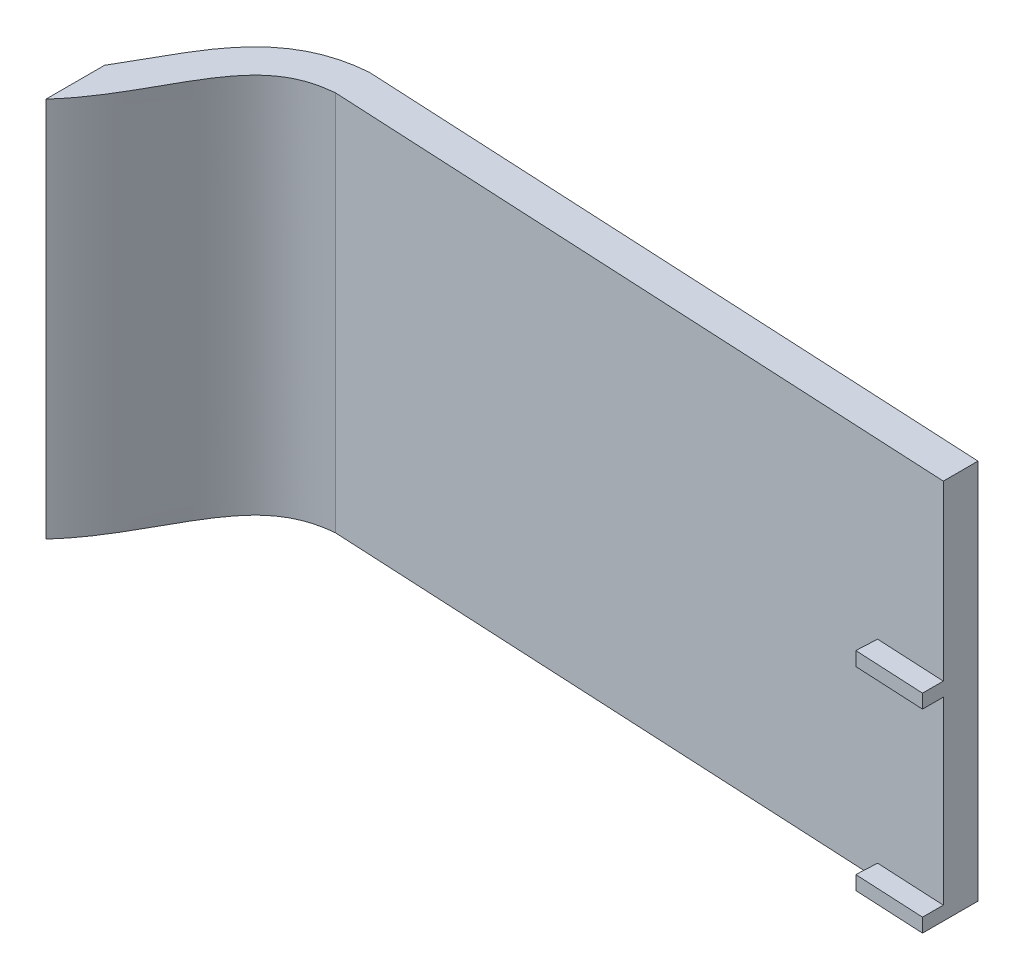
ISO-10303-21;
HEADER;
FILE_DESCRIPTION(('STEP AP214'),'2;1');
FILE_NAME('part.step','',(''),(''),'','','');
FILE_SCHEMA(('AUTOMOTIVE_DESIGN { 1 0 10303 214 1 1 1 1 }'));
ENDSEC;
DATA;
#1=APPLICATION_CONTEXT('core data for automotive mechanical design processes');
#2=APPLICATION_PROTOCOL_DEFINITION('international standard','automotive_design',2000,#1);
#3=PRODUCT_CONTEXT('',#1,'mechanical');
#4=PRODUCT('Part','Part','',(#3));
#5=PRODUCT_RELATED_PRODUCT_CATEGORY('part','',(#4));
#6=PRODUCT_DEFINITION_FORMATION('','',#4);
#7=PRODUCT_DEFINITION_CONTEXT('part definition',#1,'design');
#8=PRODUCT_DEFINITION('design','',#6,#7);
#9=PRODUCT_DEFINITION_SHAPE('','',#8);
#10=(LENGTH_UNIT() NAMED_UNIT(*) SI_UNIT(.MILLI.,.METRE.));
#11=(NAMED_UNIT(*) PLANE_ANGLE_UNIT() SI_UNIT($,.RADIAN.));
#12=(NAMED_UNIT(*) SI_UNIT($,.STERADIAN.) SOLID_ANGLE_UNIT());
#13=UNCERTAINTY_MEASURE_WITH_UNIT(LENGTH_MEASURE(1.E-05),#10,'distance_accuracy_value','');
#14=(GEOMETRIC_REPRESENTATION_CONTEXT(3) GLOBAL_UNCERTAINTY_ASSIGNED_CONTEXT((#13)) GLOBAL_UNIT_ASSIGNED_CONTEXT((#10,
#11,#12)) REPRESENTATION_CONTEXT('',''));
#15=CARTESIAN_POINT('',(0.,0.,0.));
#16=DIRECTION('',(0.,0.,1.));
#17=DIRECTION('',(1.,0.,0.));
#18=AXIS2_PLACEMENT_3D('',#15,#16,#17);
#19=CARTESIAN_POINT('',(15.2026066350711,-55.02,-53.3815975655058));
#20=DIRECTION('',(-1.,0.,0.));
#21=DIRECTION('',(0.,0.,1.));
#22=AXIS2_PLACEMENT_3D('',#19,#20,#21);
#23=PLANE('',#22);
#24=DIRECTION('',(0.,0.,-1.));
#25=VECTOR('',#24,1.);
#26=CARTESIAN_POINT('',(15.2026066350711,-55.,32.5431279620853));
#27=LINE('',#26,#25);
#28=CARTESIAN_POINT('',(15.2026066350711,-55.,-45.3713854986732));
#29=VERTEX_POINT('',#28);
#30=CARTESIAN_POINT('',(15.2026066350711,-55.,-53.3815975655058));
#31=VERTEX_POINT('',#30);
#32=EDGE_CURVE('E42',#29,#31,#27,.T.);
#33=ORIENTED_EDGE('',*,*,#32,.T.);
#34=DIRECTION('',(0.,1.,0.));
#35=VECTOR('',#34,1.);
#36=CARTESIAN_POINT('',(15.2026066350711,-55.,-53.3815975655058));
#37=LINE('',#36,#35);
#38=CARTESIAN_POINT('',(15.2026066350711,0.,-53.3815975655058));
#39=VERTEX_POINT('',#38);
#40=EDGE_CURVE('E281',#31,#39,#37,.T.);
#41=ORIENTED_EDGE('',*,*,#40,.T.);
#42=DIRECTION('',(0.,0.,-1.));
#43=VECTOR('',#42,1.);
#44=CARTESIAN_POINT('',(15.2026066350711,0.,32.5431279620853));
#45=LINE('',#44,#43);
#46=CARTESIAN_POINT('',(15.2026066350711,0.,-48.3752150237354));
#47=VERTEX_POINT('',#46);
#48=EDGE_CURVE('E288',#47,#39,#45,.T.);
#49=ORIENTED_EDGE('',*,*,#48,.F.);
#50=DIRECTION('',(0.,1.,0.));
#51=VECTOR('',#50,1.);
#52=CARTESIAN_POINT('',(15.2026066350711,-55.,-48.3752150237354));
#53=LINE('',#52,#51);
#54=CARTESIAN_POINT('',(15.2026066350711,-25.,-48.3752150237354));
#55=VERTEX_POINT('',#54);
#56=EDGE_CURVE('E291',#55,#47,#53,.T.);
#57=ORIENTED_EDGE('',*,*,#56,.F.);
#58=DIRECTION('',(0.,0.,1.));
#59=VECTOR('',#58,1.);
#60=CARTESIAN_POINT('',(15.2026066350711,-25.,-46.0222081076461));
#61=LINE('',#60,#59);
#62=CARTESIAN_POINT('',(15.2026066350711,-25.,-45.3713854986732));
#63=VERTEX_POINT('',#62);
#64=EDGE_CURVE('E47',#55,#63,#61,.T.);
#65=ORIENTED_EDGE('',*,*,#64,.T.);
#66=DIRECTION('',(0.,-1.,0.));
#67=VECTOR('',#66,1.);
#68=CARTESIAN_POINT('',(15.2026066350711,0.,-45.3713854986732));
#69=LINE('',#68,#67);
#70=CARTESIAN_POINT('',(15.2026066350711,-27.,-45.3713854986732));
#71=VERTEX_POINT('',#70);
#72=EDGE_CURVE('E12',#63,#71,#69,.T.);
#73=ORIENTED_EDGE('',*,*,#72,.T.);
#74=DIRECTION('',(0.,0.,1.));
#75=VECTOR('',#74,1.);
#76=CARTESIAN_POINT('',(15.2026066350711,-27.,-46.0222081076461));
#77=LINE('',#76,#75);
#78=CARTESIAN_POINT('',(15.2026066350711,-27.,-48.3752150237354));
#79=VERTEX_POINT('',#78);
#80=EDGE_CURVE('E55',#79,#71,#77,.T.);
#81=ORIENTED_EDGE('',*,*,#80,.F.);
#82=CARTESIAN_POINT('',(15.2026066350711,-53.,-48.3752150237354));
#83=VERTEX_POINT('',#82);
#84=EDGE_CURVE('E284',#83,#79,#53,.T.);
#85=ORIENTED_EDGE('',*,*,#84,.F.);
#86=DIRECTION('',(0.,0.,1.));
#87=VECTOR('',#86,1.);
#88=CARTESIAN_POINT('',(15.2026066350711,-53.,-46.0222081076461));
#89=LINE('',#88,#87);
#90=CARTESIAN_POINT('',(15.2026066350711,-53.,-45.3713854986732));
#91=VERTEX_POINT('',#90);
#92=EDGE_CURVE('E292',#83,#91,#89,.T.);
#93=ORIENTED_EDGE('',*,*,#92,.T.);
#94=DIRECTION('',(0.,-1.,0.));
#95=VECTOR('',#94,1.);
#96=CARTESIAN_POINT('',(15.2026066350711,0.,-45.3713854986732));
#97=LINE('',#96,#95);
#98=EDGE_CURVE('E286',#91,#29,#97,.T.);
#99=ORIENTED_EDGE('',*,*,#98,.T.);
#100=EDGE_LOOP('',(#33,#41,#49,#57,#65,#73,#81,#85,#93,#99));
#101=FACE_BOUND('',#100,.T.);
#102=ADVANCED_FACE('F39',(#101),#23,.F.);
#103=CARTESIAN_POINT('',(2.32612383491424,-53.,-46.0222081076461));
#104=DIRECTION('',(0.,1.,0.));
#105=DIRECTION('',(0.,0.,1.));
#106=AXIS2_PLACEMENT_3D('',#103,#104,#105);
#107=PLANE('',#106);
#108=ORIENTED_EDGE('',*,*,#92,.F.);
#109=DIRECTION('',(0.998725119042121,0.,0.0504790708541747));
#110=VECTOR('',#109,1.);
#111=CARTESIAN_POINT('',(112.240105598559,-53.,-43.4705994370284));
#112=LINE('',#111,#110);
#113=CARTESIAN_POINT('',(5.21535544464988,-53.,-48.8800057322772));
#114=VERTEX_POINT('',#113);
#115=EDGE_CURVE('E289',#114,#83,#112,.T.);
#116=ORIENTED_EDGE('',*,*,#115,.F.);
#117=DIRECTION('',(0.0504790708541747,0.,-0.998725119042121));
#118=VECTOR('',#117,1.);
#119=CARTESIAN_POINT('',(5.06391823208736,-53.,-45.8838303751509));
#120=LINE('',#119,#118);
#121=CARTESIAN_POINT('',(5.06391823208736,-53.,-45.8838303751509));
#122=VERTEX_POINT('',#121);
#123=EDGE_CURVE('E270',#122,#114,#120,.T.);
#124=ORIENTED_EDGE('',*,*,#123,.F.);
#125=DIRECTION('',(0.998725119042121,0.,0.0504790708541747));
#126=VECTOR('',#125,1.);
#127=CARTESIAN_POINT('',(2.32612383491424,-53.,-46.0222081076461));
#128=LINE('',#127,#126);
#129=EDGE_CURVE('E256',#122,#91,#128,.T.);
#130=ORIENTED_EDGE('',*,*,#129,.T.);
#131=EDGE_LOOP('',(#108,#116,#124,#130));
#132=FACE_BOUND('',#131,.T.);
#133=ADVANCED_FACE('F310',(#132),#107,.T.);
#134=CARTESIAN_POINT('',(5.06391823208736,0.,-45.8838303751508));
#135=DIRECTION('',(0.998725119042121,0.,0.0504790708541747));
#136=DIRECTION('',(0.0504790708541747,0.,-0.998725119042121));
#137=AXIS2_PLACEMENT_3D('',#134,#135,#136);
#138=PLANE('',#137);
#139=DIRECTION('',(0.,-1.,0.));
#140=VECTOR('',#139,1.);
#141=CARTESIAN_POINT('',(5.21535544464988,0.,-48.8800057322772));
#142=LINE('',#141,#140);
#143=CARTESIAN_POINT('',(5.21535544464991,-55.,-48.8800057322772));
#144=VERTEX_POINT('',#143);
#145=EDGE_CURVE('E253',#114,#144,#142,.T.);
#146=ORIENTED_EDGE('',*,*,#145,.T.);
#147=DIRECTION('',(0.0504790708541747,0.,-0.998725119042121));
#148=VECTOR('',#147,1.);
#149=CARTESIAN_POINT('',(5.06391823208736,-55.,-45.8838303751508));
#150=LINE('',#149,#148);
#151=CARTESIAN_POINT('',(5.06391823208736,-55.,-45.8838303751508));
#152=VERTEX_POINT('',#151);
#153=EDGE_CURVE('E268',#152,#144,#150,.T.);
#154=ORIENTED_EDGE('',*,*,#153,.F.);
#155=DIRECTION('',(0.,-1.,0.));
#156=VECTOR('',#155,1.);
#157=CARTESIAN_POINT('',(5.06391823208736,0.,-45.8838303751508));
#158=LINE('',#157,#156);
#159=EDGE_CURVE('E263',#122,#152,#158,.T.);
#160=ORIENTED_EDGE('',*,*,#159,.F.);
#161=ORIENTED_EDGE('',*,*,#123,.T.);
#162=EDGE_LOOP('',(#146,#154,#160,#161));
#163=FACE_BOUND('',#162,.T.);
#164=ADVANCED_FACE('F308',(#163),#138,.F.);
#165=CARTESIAN_POINT('',(2.32612383491424,0.,-46.0222081076461));
#166=DIRECTION('',(-0.0504790708541747,0.,0.998725119042121));
#167=DIRECTION('',(0.998725119042121,0.,0.0504790708541747));
#168=AXIS2_PLACEMENT_3D('',#165,#166,#167);
#169=PLANE('',#168);
#170=ORIENTED_EDGE('',*,*,#98,.F.);
#171=ORIENTED_EDGE('',*,*,#129,.F.);
#172=ORIENTED_EDGE('',*,*,#159,.T.);
#173=DIRECTION('',(0.998725119042121,0.,0.0504790708541747));
#174=VECTOR('',#173,1.);
#175=CARTESIAN_POINT('',(2.32612383491424,-55.,-46.0222081076461));
#176=LINE('',#175,#174);
#177=EDGE_CURVE('E266',#152,#29,#176,.T.);
#178=ORIENTED_EDGE('',*,*,#177,.T.);
#179=EDGE_LOOP('',(#170,#171,#172,#178));
#180=FACE_BOUND('',#179,.T.);
#181=ADVANCED_FACE('F306',(#180),#169,.T.);
#182=CARTESIAN_POINT('',(-77.2973933649289,-55.,-58.0568720379147));
#183=DIRECTION('',(0.0504790708541746,0.,-0.998725119042121));
#184=DIRECTION('',(-0.998725119042121,0.,-0.0504790708541746));
#185=AXIS2_PLACEMENT_3D('',#182,#183,#184);
#186=PLANE('',#185);
#187=ORIENTED_EDGE('',*,*,#40,.F.);
#188=DIRECTION('',(-0.998725119042121,0.,-0.0504790708541746));
#189=VECTOR('',#188,1.);
#190=CARTESIAN_POINT('',(-77.2973933649289,-55.,-58.0568720379147));
#191=LINE('',#190,#189);
#192=CARTESIAN_POINT('',(-77.2973933649289,-55.,-58.0568720379147));
#193=VERTEX_POINT('',#192);
#194=EDGE_CURVE('E275',#31,#193,#191,.T.);
#195=ORIENTED_EDGE('',*,*,#194,.T.);
#196=DIRECTION('',(0.,1.,0.));
#197=VECTOR('',#196,1.);
#198=CARTESIAN_POINT('',(-77.2973933649289,-55.,-58.0568720379147));
#199=LINE('',#198,#197);
#200=CARTESIAN_POINT('',(-77.2973933649289,0.,-58.0568720379147));
#201=VERTEX_POINT('',#200);
#202=EDGE_CURVE('E188',#193,#201,#199,.T.);
#203=ORIENTED_EDGE('',*,*,#202,.T.);
#204=DIRECTION('',(-0.998725119042121,0.,-0.0504790708541746));
#205=VECTOR('',#204,1.);
#206=CARTESIAN_POINT('',(-77.2973933649289,0.,-58.0568720379147));
#207=LINE('',#206,#205);
#208=EDGE_CURVE('E279',#39,#201,#207,.T.);
#209=ORIENTED_EDGE('',*,*,#208,.F.);
#210=EDGE_LOOP('',(#187,#195,#203,#209));
#211=FACE_BOUND('',#210,.T.);
#212=ADVANCED_FACE('F316',(#211),#186,.T.);
#213=CARTESIAN_POINT('',(112.240105598559,-55.,-43.4705994370284));
#214=DIRECTION('',(0.0504790708541747,0.,-0.998725119042121));
#215=DIRECTION('',(-0.998725119042121,0.,-0.0504790708541747));
#216=AXIS2_PLACEMENT_3D('',#213,#214,#215);
#217=PLANE('',#216);
#218=ORIENTED_EDGE('',*,*,#115,.T.);
#219=ORIENTED_EDGE('',*,*,#84,.T.);
#220=DIRECTION('',(0.998725119042121,0.,0.0504790708541744));
#221=VECTOR('',#220,1.);
#222=CARTESIAN_POINT('',(5.21535544464988,-27.,-48.8800057322772));
#223=LINE('',#222,#221);
#224=CARTESIAN_POINT('',(5.21535544464988,-27.,-48.8800057322772));
#225=VERTEX_POINT('',#224);
#226=EDGE_CURVE('E143',#225,#79,#223,.T.);
#227=ORIENTED_EDGE('',*,*,#226,.F.);
#228=DIRECTION('',(0.,-1.,0.));
#229=VECTOR('',#228,1.);
#230=CARTESIAN_POINT('',(5.21535544464986,0.,-48.8800057322772));
#231=LINE('',#230,#229);
#232=CARTESIAN_POINT('',(5.21535544464988,-25.,-48.8800057322772));
#233=VERTEX_POINT('',#232);
#234=EDGE_CURVE('E150',#233,#225,#231,.T.);
#235=ORIENTED_EDGE('',*,*,#234,.F.);
#236=DIRECTION('',(0.998725119042121,0.,0.0504790708541744));
#237=VECTOR('',#236,1.);
#238=CARTESIAN_POINT('',(5.21535544464988,-25.,-48.8800057322772));
#239=LINE('',#238,#237);
#240=EDGE_CURVE('E134',#233,#55,#239,.T.);
#241=ORIENTED_EDGE('',*,*,#240,.T.);
#242=ORIENTED_EDGE('',*,*,#56,.T.);
#243=DIRECTION('',(-0.998725119042121,0.,-0.0504790708541747));
#244=VECTOR('',#243,1.);
#245=CARTESIAN_POINT('',(112.240105598559,0.,-43.4705994370284));
#246=LINE('',#245,#244);
#247=CARTESIAN_POINT('',(-77.2198387862859,0.,-53.046569615693));
#248=VERTEX_POINT('',#247);
#249=EDGE_CURVE('E272',#47,#248,#246,.T.);
#250=ORIENTED_EDGE('',*,*,#249,.T.);
#251=DIRECTION('',(0.,1.,0.));
#252=VECTOR('',#251,1.);
#253=CARTESIAN_POINT('',(-77.2198387862859,-55.,-53.046569615693));
#254=LINE('',#253,#252);
#255=CARTESIAN_POINT('',(-77.2198387862859,-55.,-53.046569615693));
#256=VERTEX_POINT('',#255);
#257=EDGE_CURVE('E182',#256,#248,#254,.T.);
#258=ORIENTED_EDGE('',*,*,#257,.F.);
#259=DIRECTION('',(-0.998725119042121,0.,-0.0504790708541747));
#260=VECTOR('',#259,1.);
#261=CARTESIAN_POINT('',(112.240105598559,-55.,-43.4705994370284));
#262=LINE('',#261,#260);
#263=EDGE_CURVE('E194',#144,#256,#262,.T.);
#264=ORIENTED_EDGE('',*,*,#263,.F.);
#265=ORIENTED_EDGE('',*,*,#145,.F.);
#266=EDGE_LOOP('',(#218,#219,#227,#235,#241,#242,#250,#258,#264,#265));
#267=FACE_BOUND('',#266,.T.);
#268=ADVANCED_FACE('F157',(#267),#217,.F.);
#269=CARTESIAN_POINT('',(2.32612383491424,-27.,-46.0222081076461));
#270=DIRECTION('',(0.,1.,0.));
#271=DIRECTION('',(0.,0.,1.));
#272=AXIS2_PLACEMENT_3D('',#269,#270,#271);
#273=PLANE('',#272);
#274=ORIENTED_EDGE('',*,*,#226,.T.);
#275=ORIENTED_EDGE('',*,*,#80,.T.);
#276=DIRECTION('',(0.998725119042121,0.,0.0504790708541744));
#277=VECTOR('',#276,1.);
#278=CARTESIAN_POINT('',(5.06391823208736,-27.,-45.8838303751508));
#279=LINE('',#278,#277);
#280=CARTESIAN_POINT('',(5.06391823208736,-27.,-45.8838303751509));
#281=VERTEX_POINT('',#280);
#282=EDGE_CURVE('E144',#281,#71,#279,.T.);
#283=ORIENTED_EDGE('',*,*,#282,.F.);
#284=DIRECTION('',(0.0504790708541747,0.,-0.998725119042121));
#285=VECTOR('',#284,1.);
#286=CARTESIAN_POINT('',(5.06391823208736,-27.,-45.8838303751509));
#287=LINE('',#286,#285);
#288=EDGE_CURVE('E154',#281,#225,#287,.T.);
#289=ORIENTED_EDGE('',*,*,#288,.T.);
#290=EDGE_LOOP('',(#274,#275,#283,#289));
#291=FACE_BOUND('',#290,.T.);
#292=ADVANCED_FACE('F365',(#291),#273,.F.);
#293=CARTESIAN_POINT('',(5.06391823208733,0.,-45.8838303751509));
#294=DIRECTION('',(0.998725119042121,0.,0.0504790708541747));
#295=DIRECTION('',(0.0504790708541747,0.,-0.998725119042121));
#296=AXIS2_PLACEMENT_3D('',#293,#294,#295);
#297=PLANE('',#296);
#298=ORIENTED_EDGE('',*,*,#234,.T.);
#299=ORIENTED_EDGE('',*,*,#288,.F.);
#300=DIRECTION('',(0.,-1.,0.));
#301=VECTOR('',#300,1.);
#302=CARTESIAN_POINT('',(5.06391823208733,0.,-45.8838303751509));
#303=LINE('',#302,#301);
#304=CARTESIAN_POINT('',(5.06391823208735,-25.,-45.8838303751509));
#305=VERTEX_POINT('',#304);
#306=EDGE_CURVE('E153',#305,#281,#303,.T.);
#307=ORIENTED_EDGE('',*,*,#306,.F.);
#308=DIRECTION('',(0.0504790708541747,0.,-0.998725119042121));
#309=VECTOR('',#308,1.);
#310=CARTESIAN_POINT('',(5.06391823208735,-25.,-45.8838303751509));
#311=LINE('',#310,#309);
#312=EDGE_CURVE('E138',#305,#233,#311,.T.);
#313=ORIENTED_EDGE('',*,*,#312,.T.);
#314=EDGE_LOOP('',(#298,#299,#307,#313));
#315=FACE_BOUND('',#314,.T.);
#316=ADVANCED_FACE('F148',(#315),#297,.F.);
#317=CARTESIAN_POINT('',(2.32612383491424,-25.,-46.0222081076461));
#318=DIRECTION('',(0.,1.,0.));
#319=DIRECTION('',(0.,0.,1.));
#320=AXIS2_PLACEMENT_3D('',#317,#318,#319);
#321=PLANE('',#320);
#322=ORIENTED_EDGE('',*,*,#64,.F.);
#323=ORIENTED_EDGE('',*,*,#240,.F.);
#324=ORIENTED_EDGE('',*,*,#312,.F.);
#325=DIRECTION('',(0.998725119042121,0.,0.0504790708541744));
#326=VECTOR('',#325,1.);
#327=CARTESIAN_POINT('',(5.06391823208735,-25.,-45.8838303751508));
#328=LINE('',#327,#326);
#329=EDGE_CURVE('E158',#305,#63,#328,.T.);
#330=ORIENTED_EDGE('',*,*,#329,.T.);
#331=EDGE_LOOP('',(#322,#323,#324,#330));
#332=FACE_BOUND('',#331,.T.);
#333=ADVANCED_FACE('F136',(#332),#321,.T.);
#334=CARTESIAN_POINT('',(2.32612383491424,0.,-46.0222081076461));
#335=DIRECTION('',(-0.0504790708541747,0.,0.998725119042121));
#336=DIRECTION('',(0.998725119042121,0.,0.0504790708541747));
#337=AXIS2_PLACEMENT_3D('',#334,#335,#336);
#338=PLANE('',#337);
#339=ORIENTED_EDGE('',*,*,#72,.F.);
#340=ORIENTED_EDGE('',*,*,#329,.F.);
#341=ORIENTED_EDGE('',*,*,#306,.T.);
#342=ORIENTED_EDGE('',*,*,#282,.T.);
#343=EDGE_LOOP('',(#339,#340,#341,#342));
#344=FACE_BOUND('',#343,.T.);
#345=ADVANCED_FACE('F220',(#344),#338,.T.);
#346=CARTESIAN_POINT('',(-115.897393364929,-55.,32.5431279620853));
#347=DIRECTION('',(0.,-1.,0.));
#348=DIRECTION('',(0.,0.,-1.));
#349=AXIS2_PLACEMENT_3D('',#346,#347,#348);
#350=PLANE('',#349);
#351=ORIENTED_EDGE('',*,*,#32,.F.);
#352=ORIENTED_EDGE('',*,*,#177,.F.);
#353=ORIENTED_EDGE('',*,*,#153,.T.);
#354=ORIENTED_EDGE('',*,*,#263,.T.);
#355=CARTESIAN_POINT('',(-97.2973933649313,-55.,-31.372357527614));
#356=CARTESIAN_POINT('',(-97.0762379954074,-55.,-31.6135087040705));
#357=CARTESIAN_POINT('',(-96.8598655505629,-55.,-31.858322069258));
#358=CARTESIAN_POINT('',(-95.3710795374342,-55.,-33.6018494298287));
#359=CARTESIAN_POINT('',(-94.2559605880488,-55.,-35.2210007348924));
#360=CARTESIAN_POINT('',(-92.1889006910485,-55.,-38.5842454420212));
#361=CARTESIAN_POINT('',(-91.239394157803,-55.,-40.3268964139393));
#362=CARTESIAN_POINT('',(-89.7895274845596,-55.,-42.9202981678916));
#363=CARTESIAN_POINT('',(-89.3013657933868,-55.,-43.7816296814817));
#364=CARTESIAN_POINT('',(-88.2803210373799,-55.,-45.4755136707428));
#365=CARTESIAN_POINT('',(-87.7477903143406,-55.,-46.3082928849293));
#366=CARTESIAN_POINT('',(-86.5897084315104,-55.,-47.9139909275994));
#367=CARTESIAN_POINT('',(-85.9649374730181,-55.,-48.687411830168));
#368=CARTESIAN_POINT('',(-84.8995008652825,-55.,-49.7649925024481));
#369=CARTESIAN_POINT('',(-84.5279584796243,-55.,-50.1043558127931));
#370=CARTESIAN_POINT('',(-83.7517404069968,-55.,-50.7315635238566));
#371=CARTESIAN_POINT('',(-83.3462808449211,-55.,-51.020113337442));
#372=CARTESIAN_POINT('',(-82.4970837959284,-55.,-51.5419398998227));
#373=CARTESIAN_POINT('',(-82.0533306154238,-55.,-51.7751939871832));
#374=CARTESIAN_POINT('',(-81.1262020608835,-55.,-52.1844879822103));
#375=CARTESIAN_POINT('',(-80.6523602197194,-55.,-52.3563307980046));
#376=CARTESIAN_POINT('',(-79.2131574432312,-55.,-52.7843591239132));
#377=CARTESIAN_POINT('',(-78.2262543751866,-55.,-52.9559279571816));
#378=CARTESIAN_POINT('',(-77.2198387862859,-55.,-53.046569615693));
#379=B_SPLINE_CURVE_WITH_KNOTS('',3,(#355,#356,#357,#358,#359,#360,#361,#362,#363,#364,#365,
#366,#367,#368,#369,#370,#371,#372,#373,#374,#375,#376,#377,#378),.UNSPECIFIED.,.F.,.F.,(4,2,2,
2,2,2,2,2,2,2,2,4),(0.,0.0207485576749125,0.145748557674912,0.270748557674912,0.333248557674912,
0.395748557674912,0.458248557674912,0.489498557674911,0.520748557674911,0.551998557674911,
0.58324855767491,0.64574855767491),.UNSPECIFIED.);
#380=CARTESIAN_POINT('',(-97.2973933649289,-55.,-31.3723575276166));
#381=VERTEX_POINT('',#380);
#382=EDGE_CURVE('E236',#256,#381,#379,.F.);
#383=ORIENTED_EDGE('',*,*,#382,.T.);
#384=DIRECTION('',(0.,0.,-1.));
#385=VECTOR('',#384,1.);
#386=CARTESIAN_POINT('',(-97.2973933577951,-55.,32.5431279620854));
#387=LINE('',#386,#385);
#388=CARTESIAN_POINT('',(-97.2973933577945,-55.,-39.823610008286));
#389=VERTEX_POINT('',#388);
#390=EDGE_CURVE('E189',#381,#389,#387,.T.);
#391=ORIENTED_EDGE('',*,*,#390,.T.);
#392=CARTESIAN_POINT('',(-77.2973933649289,-55.,-58.0568720379147));
#393=CARTESIAN_POINT('',(-97.4782956804952,-55.,-56.5585431866768));
#394=CARTESIAN_POINT('',(-92.6699085338428,-55.,-31.2993802591503));
#395=CARTESIAN_POINT('',(-112.297393364929,-55.,-29.0568720379147));
#396=B_SPLINE_CURVE_WITH_KNOTS('',3,(#392,#393,#394,#395),.UNSPECIFIED.,.F.,.F.,(4,4),(0.,1.),.UNSPECIFIED.);
#397=EDGE_CURVE('E173',#193,#389,#396,.T.);
#398=ORIENTED_EDGE('',*,*,#397,.F.);
#399=ORIENTED_EDGE('',*,*,#194,.F.);
#400=EDGE_LOOP('',(#351,#352,#353,#354,#383,#391,#398,#399));
#401=FACE_BOUND('',#400,.T.);
#402=ADVANCED_FACE('F304',(#401),#350,.T.);
#403=CARTESIAN_POINT('',(-115.897393364929,0.,32.5431279620853));
#404=DIRECTION('',(0.,-1.,0.));
#405=DIRECTION('',(0.,0.,-1.));
#406=AXIS2_PLACEMENT_3D('',#403,#404,#405);
#407=PLANE('',#406);
#408=ORIENTED_EDGE('',*,*,#249,.F.);
#409=ORIENTED_EDGE('',*,*,#48,.T.);
#410=ORIENTED_EDGE('',*,*,#208,.T.);
#411=CARTESIAN_POINT('',(-77.2973933649289,0.,-58.0568720379147));
#412=CARTESIAN_POINT('',(-97.4782956804952,0.,-56.5585431866768));
#413=CARTESIAN_POINT('',(-92.6699085338428,0.,-31.2993802591503));
#414=CARTESIAN_POINT('',(-112.297393364929,0.,-29.0568720379147));
#415=B_SPLINE_CURVE_WITH_KNOTS('',3,(#411,#412,#413,#414),.UNSPECIFIED.,.F.,.F.,(4,4),(0.,1.),.UNSPECIFIED.);
#416=CARTESIAN_POINT('',(-97.2973933480429,0.,-39.8236100243836));
#417=VERTEX_POINT('',#416);
#418=EDGE_CURVE('E178',#201,#417,#415,.T.);
#419=ORIENTED_EDGE('',*,*,#418,.T.);
#420=DIRECTION('',(0.,0.,-1.));
#421=VECTOR('',#420,1.);
#422=CARTESIAN_POINT('',(-97.2973933577951,0.,32.5431279620854));
#423=LINE('',#422,#421);
#424=CARTESIAN_POINT('',(-97.2973933649289,0.,-31.3723575276166));
#425=VERTEX_POINT('',#424);
#426=EDGE_CURVE('E167',#425,#417,#423,.T.);
#427=ORIENTED_EDGE('',*,*,#426,.F.);
#428=CARTESIAN_POINT('',(-77.2198387862859,0.,-53.046569615693));
#429=CARTESIAN_POINT('',(-78.2262543751866,0.,-52.9559279571816));
#430=CARTESIAN_POINT('',(-79.2131574432312,0.,-52.7843591239132));
#431=CARTESIAN_POINT('',(-80.6523602197194,0.,-52.3563307980046));
#432=CARTESIAN_POINT('',(-81.1262020608835,0.,-52.1844879822103));
#433=CARTESIAN_POINT('',(-82.0533306154238,0.,-51.7751939871832));
#434=CARTESIAN_POINT('',(-82.4970837959284,0.,-51.5419398998227));
#435=CARTESIAN_POINT('',(-83.3462808449211,0.,-51.020113337442));
#436=CARTESIAN_POINT('',(-83.7517404069968,0.,-50.7315635238566));
#437=CARTESIAN_POINT('',(-84.5279584796243,0.,-50.1043558127931));
#438=CARTESIAN_POINT('',(-84.8995008652825,0.,-49.7649925024481));
#439=CARTESIAN_POINT('',(-85.9649374730181,0.,-48.687411830168));
#440=CARTESIAN_POINT('',(-86.5897084315104,0.,-47.9139909275994));
#441=CARTESIAN_POINT('',(-87.7477903143406,0.,-46.3082928849293));
#442=CARTESIAN_POINT('',(-88.2803210373799,0.,-45.4755136707428));
#443=CARTESIAN_POINT('',(-89.3013657933868,0.,-43.7816296814817));
#444=CARTESIAN_POINT('',(-89.7895274845596,0.,-42.9202981678916));
#445=CARTESIAN_POINT('',(-91.239394157803,0.,-40.3268964139393));
#446=CARTESIAN_POINT('',(-92.1889006910485,0.,-38.5842454420212));
#447=CARTESIAN_POINT('',(-94.2559605880488,0.,-35.2210007348924));
#448=CARTESIAN_POINT('',(-95.3710795374342,0.,-33.6018494298287));
#449=CARTESIAN_POINT('',(-96.8598655505629,0.,-31.858322069258));
#450=CARTESIAN_POINT('',(-97.0762379954074,0.,-31.6135087040705));
#451=CARTESIAN_POINT('',(-97.2973933649313,0.,-31.372357527614));
#452=B_SPLINE_CURVE_WITH_KNOTS('',3,(#428,#429,#430,#431,#432,#433,#434,#435,#436,#437,#438,
#439,#440,#441,#442,#443,#444,#445,#446,#447,#448,#449,#450,#451),.UNSPECIFIED.,.F.,.F.,(4,2,2,
2,2,2,2,2,2,2,2,4),(0.,0.0624999999999994,0.0937499999999991,0.124999999999999,
0.156249999999999,0.187499999999998,0.249999999999998,0.312499999999998,0.374999999999998,
0.499999999999997,0.624999999999997,0.64574855767491),.UNSPECIFIED.);
#453=EDGE_CURVE('E250',#248,#425,#452,.T.);
#454=ORIENTED_EDGE('',*,*,#453,.F.);
#455=EDGE_LOOP('',(#408,#409,#410,#419,#427,#454));
#456=FACE_BOUND('',#455,.T.);
#457=ADVANCED_FACE('F218',(#456),#407,.F.);
#458=CARTESIAN_POINT('',(-77.2198387862859,-55.,-53.046569615693));
#459=CARTESIAN_POINT('',(-78.2262543751866,-55.,-52.9559279571816));
#460=CARTESIAN_POINT('',(-79.2131574432312,-55.,-52.7843591239132));
#461=CARTESIAN_POINT('',(-80.6523602197194,-55.,-52.3563307980046));
#462=CARTESIAN_POINT('',(-81.1262020608835,-55.,-52.1844879822103));
#463=CARTESIAN_POINT('',(-82.0533306154238,-55.,-51.7751939871832));
#464=CARTESIAN_POINT('',(-82.4970837959284,-55.,-51.5419398998227));
#465=CARTESIAN_POINT('',(-83.3462808449211,-55.,-51.020113337442));
#466=CARTESIAN_POINT('',(-83.7517404069968,-55.,-50.7315635238566));
#467=CARTESIAN_POINT('',(-84.5279584796243,-55.,-50.1043558127931));
#468=CARTESIAN_POINT('',(-84.8995008652825,-55.,-49.7649925024481));
#469=CARTESIAN_POINT('',(-85.9649374730181,-55.,-48.687411830168));
#470=CARTESIAN_POINT('',(-86.5897084315104,-55.,-47.9139909275994));
#471=CARTESIAN_POINT('',(-87.7477903143406,-55.,-46.3082928849293));
#472=CARTESIAN_POINT('',(-88.2803210373799,-55.,-45.4755136707428));
#473=CARTESIAN_POINT('',(-89.3013657933868,-55.,-43.7816296814817));
#474=CARTESIAN_POINT('',(-89.7895274845596,-55.,-42.9202981678916));
#475=CARTESIAN_POINT('',(-91.239394157803,-55.,-40.3268964139393));
#476=CARTESIAN_POINT('',(-92.1889006910485,-55.,-38.5842454420212));
#477=CARTESIAN_POINT('',(-94.2559605880488,-55.,-35.2210007348924));
#478=CARTESIAN_POINT('',(-95.3710795374342,-55.,-33.6018494298287));
#479=CARTESIAN_POINT('',(-97.2863463634995,-55.,-31.3588675072482));
#480=CARTESIAN_POINT('',(-97.9649740249984,-55.,-30.6419913177298));
#481=CARTESIAN_POINT('',(-99.0576526878583,-55.,-29.6239017740352));
#482=CARTESIAN_POINT('',(-99.4327830600217,-55.,-29.2956835145216));
#483=CARTESIAN_POINT('',(-100.19872474967,-55.,-28.6685956291428));
#484=CARTESIAN_POINT('',(-100.590528753627,-55.,-28.3687841353644));
#485=CARTESIAN_POINT('',(-101.793027103589,-55.,-27.5114593622845));
#486=CARTESIAN_POINT('',(-102.63082876752,-55.,-26.9960884074813));
#487=CARTESIAN_POINT('',(-103.94345214554,-55.,-26.3099692358098));
#488=CARTESIAN_POINT('',(-104.39030697633,-55.,-26.0957423732665));
#489=CARTESIAN_POINT('',(-105.302874533562,-55.,-25.6966060288271));
#490=CARTESIAN_POINT('',(-105.766909261304,-55.,-25.512558337699));
#491=CARTESIAN_POINT('',(-107.166792436863,-55.,-25.0107620662119));
#492=CARTESIAN_POINT('',(-108.116164030456,-55.,-24.7407226830583));
#493=CARTESIAN_POINT('',(-109.561842069736,-55.,-24.4221822804123));
#494=CARTESIAN_POINT('',(-110.047341668155,-55.,-24.3304358393862));
#495=CARTESIAN_POINT('',(-110.780709358253,-55.,-24.2132978881815));
#496=CARTESIAN_POINT('',(-111.026018469355,-55.,-24.1776661857458));
#497=CARTESIAN_POINT('',(-111.518296293992,-55.,-24.1130439598351));
#498=CARTESIAN_POINT('',(-111.765529173571,-55.,-24.0851105413321));
#499=CARTESIAN_POINT('',(-112.012685813725,-55.,-24.0568720379147));
#500=B_SPLINE_CURVE_WITH_KNOTS('',3,(#458,#459,#460,#461,#462,#463,#464,#465,#466,#467,#468,
#469,#470,#471,#472,#473,#474,#475,#476,#477,#478,#479,#480,#481,#482,#483,#484,#485,#486,#487,
#488,#489,#490,#491,#492,#493,#494,#495,#496,#497,#498,#499),.UNSPECIFIED.,.F.,.F.,(4,2,2,2,2,2,
2,2,2,2,2,2,2,2,2,2,2,2,2,2,4),(0.,0.0624999999999994,0.0937499999999991,0.124999999999999,
0.156249999999999,0.187499999999998,0.249999999999998,0.312499999999998,0.374999999999998,
0.499999999999997,0.624999999999997,0.687499999999998,0.718749999999998,0.749999999999998,
0.812499999999997,0.843749999999998,0.874999999999998,0.937499999999999,0.968749999999999,
0.984375,1.),.UNSPECIFIED.);
#501=DIRECTION('',(0.,1.,0.));
#502=VECTOR('',#501,1.);
#503=SURFACE_OF_LINEAR_EXTRUSION('',#500,#502);
#504=ORIENTED_EDGE('',*,*,#453,.T.);
#505=DIRECTION('',(0.,1.,0.));
#506=VECTOR('',#505,1.);
#507=CARTESIAN_POINT('',(-97.2973933649289,-55.,-31.3723575276166));
#508=LINE('',#507,#506);
#509=EDGE_CURVE('E164',#381,#425,#508,.T.);
#510=ORIENTED_EDGE('',*,*,#509,.F.);
#511=ORIENTED_EDGE('',*,*,#382,.F.);
#512=ORIENTED_EDGE('',*,*,#257,.T.);
#513=EDGE_LOOP('',(#504,#510,#511,#512));
#514=FACE_BOUND('',#513,.T.);
#515=ADVANCED_FACE('F206',(#514),#503,.F.);
#516=DIRECTION('',(0.,1.,0.));
#517=VECTOR('',#516,1.);
#518=SURFACE_OF_LINEAR_EXTRUSION('',#396,#517);
#519=ORIENTED_EDGE('',*,*,#397,.T.);
#520=DIRECTION('',(0.,1.,0.));
#521=VECTOR('',#520,1.);
#522=CARTESIAN_POINT('',(-97.2973933577945,-55.,-39.823610008286));
#523=LINE('',#522,#521);
#524=EDGE_CURVE('E183',#389,#417,#523,.T.);
#525=ORIENTED_EDGE('',*,*,#524,.T.);
#526=ORIENTED_EDGE('',*,*,#418,.F.);
#527=ORIENTED_EDGE('',*,*,#202,.F.);
#528=EDGE_LOOP('',(#519,#525,#526,#527));
#529=FACE_BOUND('',#528,.T.);
#530=ADVANCED_FACE('F217',(#529),#518,.T.);
#531=CARTESIAN_POINT('',(-97.2973933577945,-55.02,-39.823610008286));
#532=DIRECTION('',(-1.,0.,0.));
#533=DIRECTION('',(0.,0.,1.));
#534=AXIS2_PLACEMENT_3D('',#531,#532,#533);
#535=PLANE('',#534);
#536=ORIENTED_EDGE('',*,*,#390,.F.);
#537=ORIENTED_EDGE('',*,*,#509,.T.);
#538=ORIENTED_EDGE('',*,*,#426,.T.);
#539=ORIENTED_EDGE('',*,*,#524,.F.);
#540=EDGE_LOOP('',(#536,#537,#538,#539));
#541=FACE_BOUND('',#540,.T.);
#542=ADVANCED_FACE('F321',(#541),#535,.T.);
#543=CLOSED_SHELL('',(#102,#133,#164,#181,#212,#268,#292,#316,#333,#345,#402,#457,#515,#530,#542));
#544=MANIFOLD_SOLID_BREP('B2',#543);
#545=ADVANCED_BREP_SHAPE_REPRESENTATION('',(#18,#544),#14);
#546=SHAPE_DEFINITION_REPRESENTATION(#9,#545);
ENDSEC;
END-ISO-10303-21;
